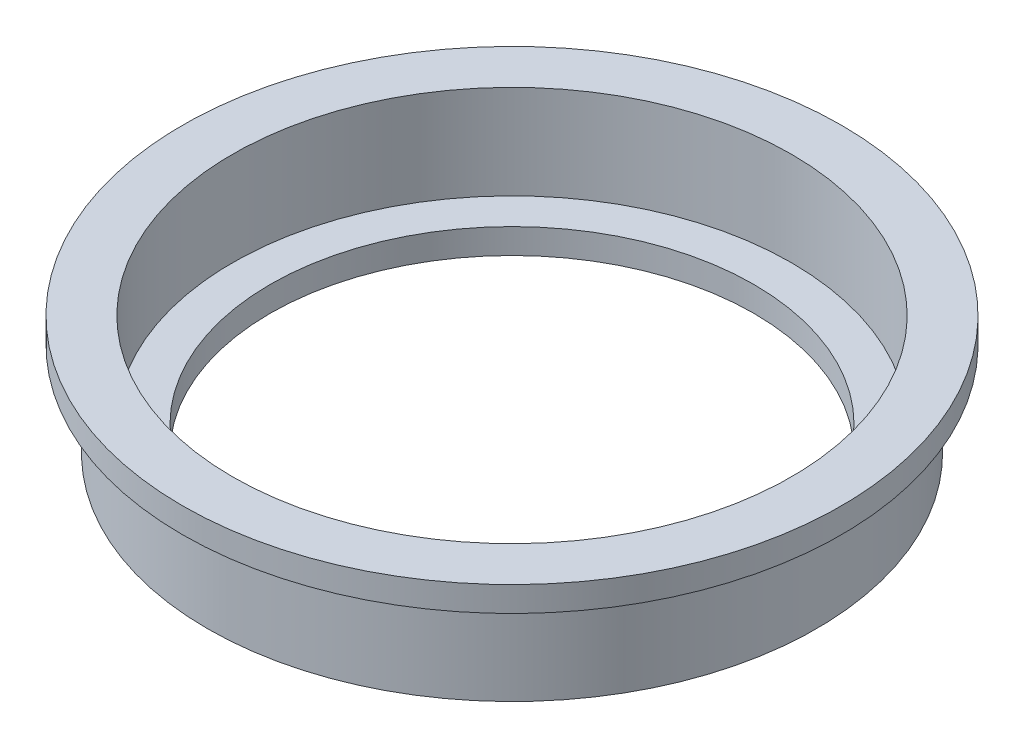
ISO-10303-21;
HEADER;
FILE_DESCRIPTION(('STEP AP214'),'2;1');
FILE_NAME('part.step','',(''),(''),'','','');
FILE_SCHEMA(('AUTOMOTIVE_DESIGN { 1 0 10303 214 1 1 1 1 }'));
ENDSEC;
DATA;
#1=APPLICATION_CONTEXT('core data for automotive mechanical design processes');
#2=APPLICATION_PROTOCOL_DEFINITION('international standard','automotive_design',2000,#1);
#3=PRODUCT_CONTEXT('',#1,'mechanical');
#4=PRODUCT('Part','Part','',(#3));
#5=PRODUCT_RELATED_PRODUCT_CATEGORY('part','',(#4));
#6=PRODUCT_DEFINITION_FORMATION('','',#4);
#7=PRODUCT_DEFINITION_CONTEXT('part definition',#1,'design');
#8=PRODUCT_DEFINITION('design','',#6,#7);
#9=PRODUCT_DEFINITION_SHAPE('','',#8);
#10=(LENGTH_UNIT() NAMED_UNIT(*) SI_UNIT(.MILLI.,.METRE.));
#11=(NAMED_UNIT(*) PLANE_ANGLE_UNIT() SI_UNIT($,.RADIAN.));
#12=(NAMED_UNIT(*) SI_UNIT($,.STERADIAN.) SOLID_ANGLE_UNIT());
#13=UNCERTAINTY_MEASURE_WITH_UNIT(LENGTH_MEASURE(1.E-05),#10,'distance_accuracy_value','');
#14=(GEOMETRIC_REPRESENTATION_CONTEXT(3) GLOBAL_UNCERTAINTY_ASSIGNED_CONTEXT((#13)) GLOBAL_UNIT_ASSIGNED_CONTEXT((#10,
#11,#12)) REPRESENTATION_CONTEXT('',''));
#15=CARTESIAN_POINT('',(0.,0.,0.));
#16=DIRECTION('',(0.,0.,1.));
#17=DIRECTION('',(1.,0.,0.));
#18=AXIS2_PLACEMENT_3D('',#15,#16,#17);
#19=CARTESIAN_POINT('',(30.861,0.,0.));
#20=DIRECTION('',(0.,-1.,0.));
#21=DIRECTION('',(0.,0.,-1.));
#22=AXIS2_PLACEMENT_3D('',#19,#20,#21);
#23=PLANE('',#22);
#24=CARTESIAN_POINT('',(0.,0.,0.));
#25=DIRECTION('',(0.,-1.,0.));
#26=DIRECTION('',(0.,0.,-1.));
#27=AXIS2_PLACEMENT_3D('',#24,#25,#26);
#28=CIRCLE('',#27,30.861);
#29=CARTESIAN_POINT('',(0.,0.,-30.861));
#30=VERTEX_POINT('',#29);
#31=EDGE_CURVE('E62',#30,#30,#28,.T.);
#32=ORIENTED_EDGE('',*,*,#31,.T.);
#33=EDGE_LOOP('',(#32));
#34=FACE_BOUND('',#33,.T.);
#35=CARTESIAN_POINT('',(0.,0.,0.));
#36=DIRECTION('',(0.,-1.,0.));
#37=DIRECTION('',(0.,0.,-1.));
#38=AXIS2_PLACEMENT_3D('',#35,#36,#37);
#39=CIRCLE('',#38,24.511);
#40=CARTESIAN_POINT('',(0.,0.,-24.511));
#41=VERTEX_POINT('',#40);
#42=EDGE_CURVE('E10',#41,#41,#39,.T.);
#43=ORIENTED_EDGE('',*,*,#42,.F.);
#44=EDGE_LOOP('',(#43));
#45=FACE_BOUND('',#44,.T.);
#46=ADVANCED_FACE('F34',(#34,#45),#23,.T.);
#47=CARTESIAN_POINT('',(0.,0.,0.));
#48=DIRECTION('',(0.,-1.,0.));
#49=DIRECTION('',(0.,0.,-1.));
#50=AXIS2_PLACEMENT_3D('',#47,#48,#49);
#51=CYLINDRICAL_SURFACE('',#50,24.511);
#52=ORIENTED_EDGE('',*,*,#42,.T.);
#53=EDGE_LOOP('',(#52));
#54=FACE_BOUND('',#53,.T.);
#55=CARTESIAN_POINT('',(0.,2.54000000000001,0.));
#56=DIRECTION('',(0.,-1.,0.));
#57=DIRECTION('',(0.,0.,-1.));
#58=AXIS2_PLACEMENT_3D('',#55,#56,#57);
#59=CIRCLE('',#58,24.511);
#60=CARTESIAN_POINT('',(0.,2.54000000000001,-24.511));
#61=VERTEX_POINT('',#60);
#62=EDGE_CURVE('E40',#61,#61,#59,.T.);
#63=ORIENTED_EDGE('',*,*,#62,.F.);
#64=EDGE_LOOP('',(#63));
#65=FACE_BOUND('',#64,.T.);
#66=ADVANCED_FACE('F80',(#54,#65),#51,.F.);
#67=CARTESIAN_POINT('',(24.511,2.54000000000001,0.));
#68=DIRECTION('',(0.,1.,0.));
#69=DIRECTION('',(0.,0.,1.));
#70=AXIS2_PLACEMENT_3D('',#67,#68,#69);
#71=PLANE('',#70);
#72=ORIENTED_EDGE('',*,*,#62,.T.);
#73=EDGE_LOOP('',(#72));
#74=FACE_BOUND('',#73,.T.);
#75=CARTESIAN_POINT('',(0.,2.54000000000001,0.));
#76=DIRECTION('',(0.,-1.,0.));
#77=DIRECTION('',(0.,0.,-1.));
#78=AXIS2_PLACEMENT_3D('',#75,#76,#77);
#79=CIRCLE('',#78,28.321);
#80=CARTESIAN_POINT('',(0.,2.54000000000001,-28.321));
#81=VERTEX_POINT('',#80);
#82=EDGE_CURVE('E44',#81,#81,#79,.T.);
#83=ORIENTED_EDGE('',*,*,#82,.F.);
#84=EDGE_LOOP('',(#83));
#85=FACE_BOUND('',#84,.T.);
#86=ADVANCED_FACE('F84',(#74,#85),#71,.T.);
#87=CARTESIAN_POINT('',(0.,0.,0.));
#88=DIRECTION('',(0.,-1.,0.));
#89=DIRECTION('',(0.,0.,-1.));
#90=AXIS2_PLACEMENT_3D('',#87,#88,#89);
#91=CYLINDRICAL_SURFACE('',#90,28.321);
#92=ORIENTED_EDGE('',*,*,#82,.T.);
#93=EDGE_LOOP('',(#92));
#94=FACE_BOUND('',#93,.T.);
#95=CARTESIAN_POINT('',(0.,12.065,0.));
#96=DIRECTION('',(0.,-1.,0.));
#97=DIRECTION('',(0.,0.,-1.));
#98=AXIS2_PLACEMENT_3D('',#95,#96,#97);
#99=CIRCLE('',#98,28.321);
#100=CARTESIAN_POINT('',(0.,12.065,-28.321));
#101=VERTEX_POINT('',#100);
#102=EDGE_CURVE('E48',#101,#101,#99,.T.);
#103=ORIENTED_EDGE('',*,*,#102,.F.);
#104=EDGE_LOOP('',(#103));
#105=FACE_BOUND('',#104,.T.);
#106=ADVANCED_FACE('F88',(#94,#105),#91,.F.);
#107=CARTESIAN_POINT('',(28.321,12.065,0.));
#108=DIRECTION('',(0.,1.,0.));
#109=DIRECTION('',(0.,0.,1.));
#110=AXIS2_PLACEMENT_3D('',#107,#108,#109);
#111=PLANE('',#110);
#112=ORIENTED_EDGE('',*,*,#102,.T.);
#113=EDGE_LOOP('',(#112));
#114=FACE_BOUND('',#113,.T.);
#115=CARTESIAN_POINT('',(0.,12.065,0.));
#116=DIRECTION('',(0.,-1.,0.));
#117=DIRECTION('',(0.,0.,-1.));
#118=AXIS2_PLACEMENT_3D('',#115,#116,#117);
#119=CIRCLE('',#118,33.401);
#120=CARTESIAN_POINT('',(0.,12.065,-33.401));
#121=VERTEX_POINT('',#120);
#122=EDGE_CURVE('E53',#121,#121,#119,.T.);
#123=ORIENTED_EDGE('',*,*,#122,.F.);
#124=EDGE_LOOP('',(#123));
#125=FACE_BOUND('',#124,.T.);
#126=ADVANCED_FACE('F94',(#114,#125),#111,.T.);
#127=CARTESIAN_POINT('',(0.,0.,0.));
#128=DIRECTION('',(0.,-1.,0.));
#129=DIRECTION('',(0.,0.,-1.));
#130=AXIS2_PLACEMENT_3D('',#127,#128,#129);
#131=CYLINDRICAL_SURFACE('',#130,33.401);
#132=ORIENTED_EDGE('',*,*,#122,.T.);
#133=EDGE_LOOP('',(#132));
#134=FACE_BOUND('',#133,.T.);
#135=CARTESIAN_POINT('',(0.,9.52500000000001,0.));
#136=DIRECTION('',(0.,-1.,0.));
#137=DIRECTION('',(0.,0.,-1.));
#138=AXIS2_PLACEMENT_3D('',#135,#136,#137);
#139=CIRCLE('',#138,33.401);
#140=CARTESIAN_POINT('',(0.,9.52500000000001,-33.401));
#141=VERTEX_POINT('',#140);
#142=EDGE_CURVE('E56',#141,#141,#139,.T.);
#143=ORIENTED_EDGE('',*,*,#142,.F.);
#144=EDGE_LOOP('',(#143));
#145=FACE_BOUND('',#144,.T.);
#146=ADVANCED_FACE('F76',(#134,#145),#131,.T.);
#147=CARTESIAN_POINT('',(33.401,9.52500000000001,0.));
#148=DIRECTION('',(0.,-1.,0.));
#149=DIRECTION('',(0.,0.,-1.));
#150=AXIS2_PLACEMENT_3D('',#147,#148,#149);
#151=PLANE('',#150);
#152=ORIENTED_EDGE('',*,*,#142,.T.);
#153=EDGE_LOOP('',(#152));
#154=FACE_BOUND('',#153,.T.);
#155=CARTESIAN_POINT('',(0.,9.52500000000001,0.));
#156=DIRECTION('',(0.,-1.,0.));
#157=DIRECTION('',(0.,0.,-1.));
#158=AXIS2_PLACEMENT_3D('',#155,#156,#157);
#159=CIRCLE('',#158,30.861);
#160=CARTESIAN_POINT('',(0.,9.52500000000001,-30.861));
#161=VERTEX_POINT('',#160);
#162=EDGE_CURVE('E59',#161,#161,#159,.T.);
#163=ORIENTED_EDGE('',*,*,#162,.F.);
#164=EDGE_LOOP('',(#163));
#165=FACE_BOUND('',#164,.T.);
#166=ADVANCED_FACE('F70',(#154,#165),#151,.T.);
#167=CARTESIAN_POINT('',(0.,0.,0.));
#168=DIRECTION('',(0.,-1.,0.));
#169=DIRECTION('',(0.,0.,-1.));
#170=AXIS2_PLACEMENT_3D('',#167,#168,#169);
#171=CYLINDRICAL_SURFACE('',#170,30.861);
#172=ORIENTED_EDGE('',*,*,#162,.T.);
#173=EDGE_LOOP('',(#172));
#174=FACE_BOUND('',#173,.T.);
#175=ORIENTED_EDGE('',*,*,#31,.F.);
#176=EDGE_LOOP('',(#175));
#177=FACE_BOUND('',#176,.T.);
#178=ADVANCED_FACE('F68',(#174,#177),#171,.T.);
#179=CLOSED_SHELL('',(#46,#66,#86,#106,#126,#146,#166,#178));
#180=MANIFOLD_SOLID_BREP('B2',#179);
#181=ADVANCED_BREP_SHAPE_REPRESENTATION('',(#18,#180),#14);
#182=SHAPE_DEFINITION_REPRESENTATION(#9,#181);
ENDSEC;
END-ISO-10303-21;
